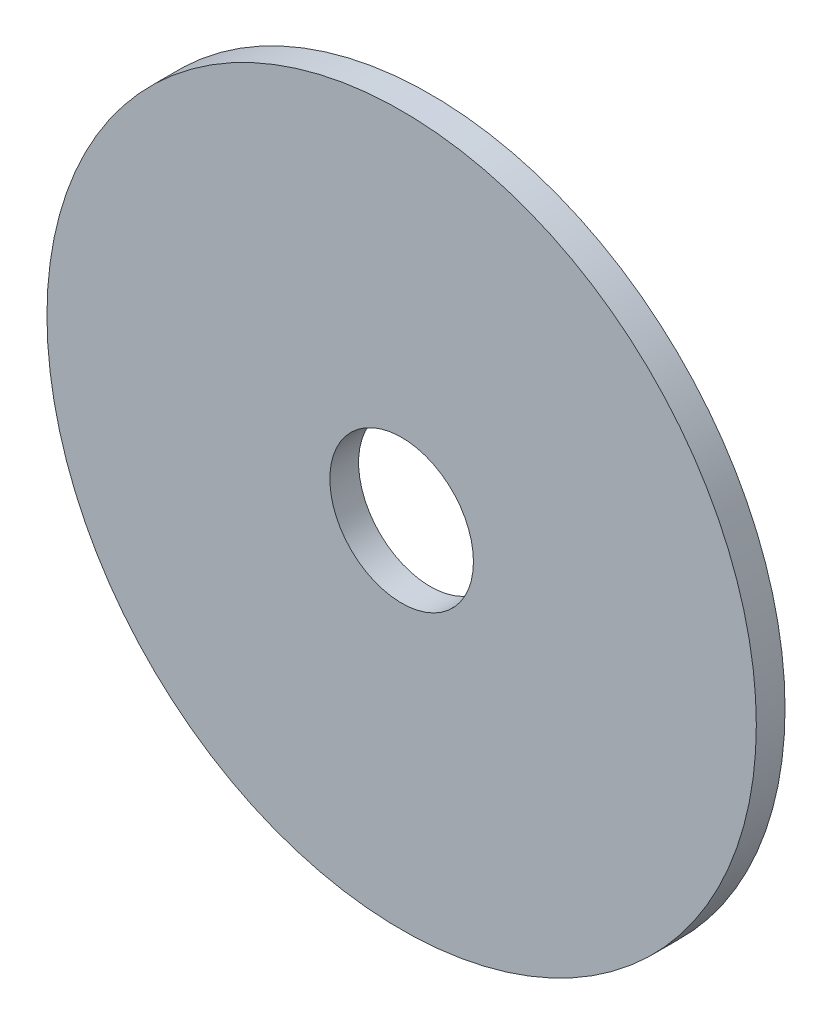
ISO-10303-21;
HEADER;
FILE_DESCRIPTION(('STEP AP214'),'2;1');
FILE_NAME('part.step','',(''),(''),'','','');
FILE_SCHEMA(('AUTOMOTIVE_DESIGN { 1 0 10303 214 1 1 1 1 }'));
ENDSEC;
DATA;
#1=APPLICATION_CONTEXT('core data for automotive mechanical design processes');
#2=APPLICATION_PROTOCOL_DEFINITION('international standard','automotive_design',2000,#1);
#3=PRODUCT_CONTEXT('',#1,'mechanical');
#4=PRODUCT('Part','Part','',(#3));
#5=PRODUCT_RELATED_PRODUCT_CATEGORY('part','',(#4));
#6=PRODUCT_DEFINITION_FORMATION('','',#4);
#7=PRODUCT_DEFINITION_CONTEXT('part definition',#1,'design');
#8=PRODUCT_DEFINITION('design','',#6,#7);
#9=PRODUCT_DEFINITION_SHAPE('','',#8);
#10=(LENGTH_UNIT() NAMED_UNIT(*) SI_UNIT(.MILLI.,.METRE.));
#11=(NAMED_UNIT(*) PLANE_ANGLE_UNIT() SI_UNIT($,.RADIAN.));
#12=(NAMED_UNIT(*) SI_UNIT($,.STERADIAN.) SOLID_ANGLE_UNIT());
#13=UNCERTAINTY_MEASURE_WITH_UNIT(LENGTH_MEASURE(1.E-05),#10,'distance_accuracy_value','');
#14=(GEOMETRIC_REPRESENTATION_CONTEXT(3) GLOBAL_UNCERTAINTY_ASSIGNED_CONTEXT((#13)) GLOBAL_UNIT_ASSIGNED_CONTEXT((#10,
#11,#12)) REPRESENTATION_CONTEXT('',''));
#15=CARTESIAN_POINT('',(0.,0.,0.));
#16=DIRECTION('',(0.,0.,1.));
#17=DIRECTION('',(1.,0.,0.));
#18=AXIS2_PLACEMENT_3D('',#15,#16,#17);
#19=CARTESIAN_POINT('',(0.,0.,1.));
#20=DIRECTION('',(0.,0.,1.));
#21=DIRECTION('',(1.,0.,0.));
#22=AXIS2_PLACEMENT_3D('',#19,#20,#21);
#23=PLANE('',#22);
#24=CARTESIAN_POINT('',(0.,0.,1.));
#25=DIRECTION('',(0.,0.,1.));
#26=DIRECTION('',(1.,0.,0.));
#27=AXIS2_PLACEMENT_3D('',#24,#25,#26);
#28=CIRCLE('',#27,12.35);
#29=CARTESIAN_POINT('',(12.35,0.,1.));
#30=VERTEX_POINT('',#29);
#31=EDGE_CURVE('E10',#30,#30,#28,.T.);
#32=ORIENTED_EDGE('',*,*,#31,.T.);
#33=EDGE_LOOP('',(#32));
#34=FACE_BOUND('',#33,.T.);
#35=CARTESIAN_POINT('',(0.,0.,1.));
#36=DIRECTION('',(0.,0.,1.));
#37=DIRECTION('',(1.,0.,0.));
#38=AXIS2_PLACEMENT_3D('',#35,#36,#37);
#39=CIRCLE('',#38,2.5);
#40=CARTESIAN_POINT('',(2.5,0.,1.));
#41=VERTEX_POINT('',#40);
#42=EDGE_CURVE('E45',#41,#41,#39,.T.);
#43=ORIENTED_EDGE('',*,*,#42,.F.);
#44=EDGE_LOOP('',(#43));
#45=FACE_BOUND('',#44,.T.);
#46=ADVANCED_FACE('F34',(#34,#45),#23,.T.);
#47=CARTESIAN_POINT('',(0.,0.,0.));
#48=DIRECTION('',(0.,0.,1.));
#49=DIRECTION('',(1.,0.,0.));
#50=AXIS2_PLACEMENT_3D('',#47,#48,#49);
#51=PLANE('',#50);
#52=CARTESIAN_POINT('',(0.,0.,0.));
#53=DIRECTION('',(0.,0.,1.));
#54=DIRECTION('',(1.,0.,0.));
#55=AXIS2_PLACEMENT_3D('',#52,#53,#54);
#56=CIRCLE('',#55,12.35);
#57=CARTESIAN_POINT('',(12.35,0.,0.));
#58=VERTEX_POINT('',#57);
#59=EDGE_CURVE('E38',#58,#58,#56,.T.);
#60=ORIENTED_EDGE('',*,*,#59,.F.);
#61=EDGE_LOOP('',(#60));
#62=FACE_BOUND('',#61,.T.);
#63=CARTESIAN_POINT('',(0.,0.,0.));
#64=DIRECTION('',(0.,0.,1.));
#65=DIRECTION('',(1.,0.,0.));
#66=AXIS2_PLACEMENT_3D('',#63,#64,#65);
#67=CIRCLE('',#66,2.5);
#68=CARTESIAN_POINT('',(2.5,0.,0.));
#69=VERTEX_POINT('',#68);
#70=EDGE_CURVE('E47',#69,#69,#67,.T.);
#71=ORIENTED_EDGE('',*,*,#70,.T.);
#72=EDGE_LOOP('',(#71));
#73=FACE_BOUND('',#72,.T.);
#74=ADVANCED_FACE('F57',(#62,#73),#51,.F.);
#75=CARTESIAN_POINT('',(0.,0.,1.));
#76=DIRECTION('',(0.,0.,-1.));
#77=DIRECTION('',(-1.,0.,0.));
#78=AXIS2_PLACEMENT_3D('',#75,#76,#77);
#79=CYLINDRICAL_SURFACE('',#78,12.35);
#80=ORIENTED_EDGE('',*,*,#31,.F.);
#81=EDGE_LOOP('',(#80));
#82=FACE_BOUND('',#81,.T.);
#83=ORIENTED_EDGE('',*,*,#59,.T.);
#84=EDGE_LOOP('',(#83));
#85=FACE_BOUND('',#84,.T.);
#86=ADVANCED_FACE('F36',(#82,#85),#79,.T.);
#87=CARTESIAN_POINT('',(0.,0.,1.));
#88=DIRECTION('',(0.,0.,-1.));
#89=DIRECTION('',(-1.,0.,0.));
#90=AXIS2_PLACEMENT_3D('',#87,#88,#89);
#91=CYLINDRICAL_SURFACE('',#90,2.5);
#92=ORIENTED_EDGE('',*,*,#42,.T.);
#93=EDGE_LOOP('',(#92));
#94=FACE_BOUND('',#93,.T.);
#95=ORIENTED_EDGE('',*,*,#70,.F.);
#96=EDGE_LOOP('',(#95));
#97=FACE_BOUND('',#96,.T.);
#98=ADVANCED_FACE('F53',(#94,#97),#91,.F.);
#99=CLOSED_SHELL('',(#46,#74,#86,#98));
#100=MANIFOLD_SOLID_BREP('B2',#99);
#101=ADVANCED_BREP_SHAPE_REPRESENTATION('',(#18,#100),#14);
#102=SHAPE_DEFINITION_REPRESENTATION(#9,#101);
ENDSEC;
END-ISO-10303-21;
